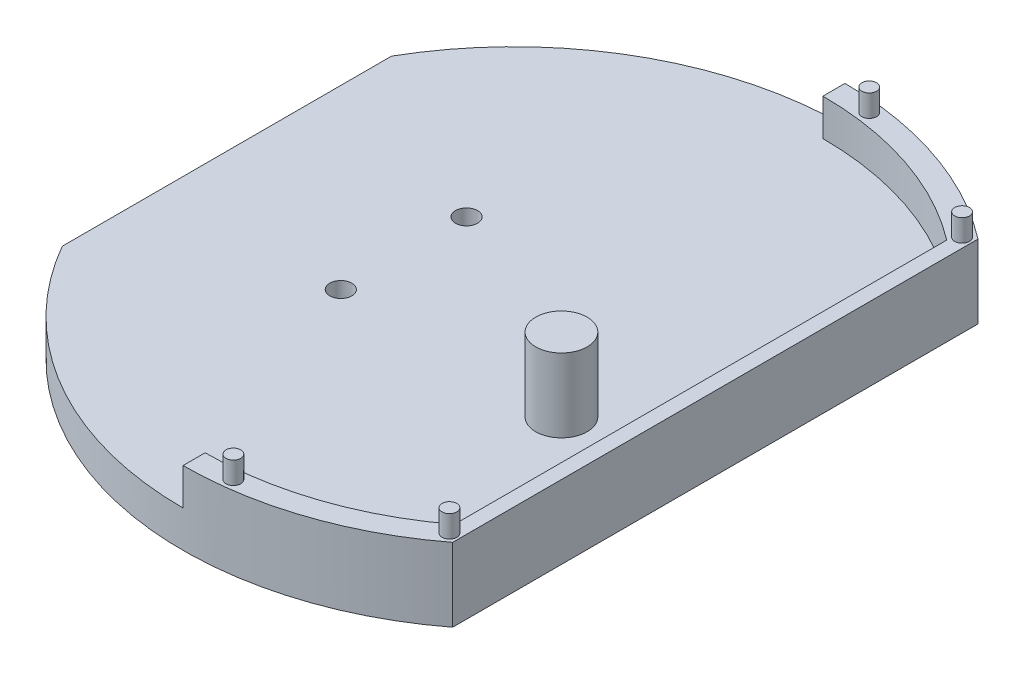
ISO-10303-21;
HEADER;
FILE_DESCRIPTION(('STEP AP214'),'2;1');
FILE_NAME('part.step','',(''),(''),'','','');
FILE_SCHEMA(('AUTOMOTIVE_DESIGN { 1 0 10303 214 1 1 1 1 }'));
ENDSEC;
DATA;
#1=APPLICATION_CONTEXT('core data for automotive mechanical design processes');
#2=APPLICATION_PROTOCOL_DEFINITION('international standard','automotive_design',2000,#1);
#3=PRODUCT_CONTEXT('',#1,'mechanical');
#4=PRODUCT('Part','Part','',(#3));
#5=PRODUCT_RELATED_PRODUCT_CATEGORY('part','',(#4));
#6=PRODUCT_DEFINITION_FORMATION('','',#4);
#7=PRODUCT_DEFINITION_CONTEXT('part definition',#1,'design');
#8=PRODUCT_DEFINITION('design','',#6,#7);
#9=PRODUCT_DEFINITION_SHAPE('','',#8);
#10=(LENGTH_UNIT() NAMED_UNIT(*) SI_UNIT(.MILLI.,.METRE.));
#11=(NAMED_UNIT(*) PLANE_ANGLE_UNIT() SI_UNIT($,.RADIAN.));
#12=(NAMED_UNIT(*) SI_UNIT($,.STERADIAN.) SOLID_ANGLE_UNIT());
#13=UNCERTAINTY_MEASURE_WITH_UNIT(LENGTH_MEASURE(1.E-05),#10,'distance_accuracy_value','');
#14=(GEOMETRIC_REPRESENTATION_CONTEXT(3) GLOBAL_UNCERTAINTY_ASSIGNED_CONTEXT((#13)) GLOBAL_UNIT_ASSIGNED_CONTEXT((#10,
#11,#12)) REPRESENTATION_CONTEXT('',''));
#15=CARTESIAN_POINT('',(0.,0.,0.));
#16=DIRECTION('',(0.,0.,1.));
#17=DIRECTION('',(1.,0.,0.));
#18=AXIS2_PLACEMENT_3D('',#15,#16,#17);
#19=CARTESIAN_POINT('',(0.,0.,0.));
#20=DIRECTION('',(0.,1.,0.));
#21=DIRECTION('',(0.,0.,1.));
#22=AXIS2_PLACEMENT_3D('',#19,#20,#21);
#23=PLANE('',#22);
#24=DIRECTION('',(0.,0.,-1.));
#25=VECTOR('',#24,1.);
#26=CARTESIAN_POINT('',(27.3745309307479,0.,0.));
#27=LINE('',#26,#25);
#28=CARTESIAN_POINT('',(27.3745309307479,0.,35.7160336028726));
#29=VERTEX_POINT('',#28);
#30=CARTESIAN_POINT('',(27.3745309307479,0.,-35.7160336028726));
#31=VERTEX_POINT('',#30);
#32=EDGE_CURVE('E247',#29,#31,#27,.T.);
#33=ORIENTED_EDGE('',*,*,#32,.F.);
#34=CARTESIAN_POINT('',(0.,0.,0.));
#35=DIRECTION('',(0.,1.,0.));
#36=DIRECTION('',(0.,0.,1.));
#37=AXIS2_PLACEMENT_3D('',#34,#35,#36);
#38=CIRCLE('',#37,45.);
#39=CARTESIAN_POINT('',(-39.0385613575621,0.,22.3828221440429));
#40=VERTEX_POINT('',#39);
#41=EDGE_CURVE('E225',#40,#29,#38,.T.);
#42=ORIENTED_EDGE('',*,*,#41,.F.);
#43=DIRECTION('',(0.,0.,-1.));
#44=VECTOR('',#43,1.);
#45=CARTESIAN_POINT('',(-39.0385613575621,0.,0.));
#46=LINE('',#45,#44);
#47=CARTESIAN_POINT('',(-39.0385613575621,0.,-22.3828221440429));
#48=VERTEX_POINT('',#47);
#49=EDGE_CURVE('E255',#40,#48,#46,.T.);
#50=ORIENTED_EDGE('',*,*,#49,.T.);
#51=CARTESIAN_POINT('',(0.,0.,0.));
#52=DIRECTION('',(0.,1.,0.));
#53=DIRECTION('',(0.,0.,1.));
#54=AXIS2_PLACEMENT_3D('',#51,#52,#53);
#55=CIRCLE('',#54,45.);
#56=EDGE_CURVE('E251',#31,#48,#55,.T.);
#57=ORIENTED_EDGE('',*,*,#56,.F.);
#58=EDGE_LOOP('',(#33,#42,#50,#57));
#59=FACE_BOUND('',#58,.T.);
#60=CARTESIAN_POINT('',(-15.,0.,-8.55000000000001));
#61=DIRECTION('',(0.,1.,0.));
#62=DIRECTION('',(0.,0.,1.));
#63=AXIS2_PLACEMENT_3D('',#60,#61,#62);
#64=CIRCLE('',#63,1.5);
#65=CARTESIAN_POINT('',(-15.,0.,-7.05000000000001));
#66=VERTEX_POINT('',#65);
#67=EDGE_CURVE('E243',#66,#66,#64,.T.);
#68=ORIENTED_EDGE('',*,*,#67,.T.);
#69=EDGE_LOOP('',(#68));
#70=FACE_BOUND('',#69,.T.);
#71=CARTESIAN_POINT('',(-15.,0.,8.54999999999999));
#72=DIRECTION('',(0.,1.,0.));
#73=DIRECTION('',(0.,0.,1.));
#74=AXIS2_PLACEMENT_3D('',#71,#72,#73);
#75=CIRCLE('',#74,1.5);
#76=CARTESIAN_POINT('',(-15.,0.,10.05));
#77=VERTEX_POINT('',#76);
#78=EDGE_CURVE('E216',#77,#77,#75,.T.);
#79=ORIENTED_EDGE('',*,*,#78,.T.);
#80=EDGE_LOOP('',(#79));
#81=FACE_BOUND('',#80,.T.);
#82=ADVANCED_FACE('F56',(#59,#70,#81),#23,.F.);
#83=CARTESIAN_POINT('',(0.,5.,0.));
#84=DIRECTION('',(0.,1.,0.));
#85=DIRECTION('',(0.,0.,1.));
#86=AXIS2_PLACEMENT_3D('',#83,#84,#85);
#87=PLANE('',#86);
#88=DIRECTION('',(0.,0.,-1.));
#89=VECTOR('',#88,1.);
#90=CARTESIAN_POINT('',(0.,5.,0.));
#91=LINE('',#90,#89);
#92=CARTESIAN_POINT('',(0.,5.,45.));
#93=VERTEX_POINT('',#92);
#94=CARTESIAN_POINT('',(0.,5.,42.));
#95=VERTEX_POINT('',#94);
#96=EDGE_CURVE('E72',#93,#95,#91,.T.);
#97=ORIENTED_EDGE('',*,*,#96,.T.);
#98=CARTESIAN_POINT('',(0.,5.,0.));
#99=DIRECTION('',(0.,1.,0.));
#100=DIRECTION('',(0.,0.,1.));
#101=AXIS2_PLACEMENT_3D('',#98,#99,#100);
#102=CIRCLE('',#101,42.);
#103=CARTESIAN_POINT('',(25.374530930748,5.,33.4683907597081));
#104=VERTEX_POINT('',#103);
#105=EDGE_CURVE('E139',#95,#104,#102,.T.);
#106=ORIENTED_EDGE('',*,*,#105,.T.);
#107=DIRECTION('',(0.,0.,-1.));
#108=VECTOR('',#107,1.);
#109=CARTESIAN_POINT('',(25.374530930748,5.,0.));
#110=LINE('',#109,#108);
#111=CARTESIAN_POINT('',(25.374530930748,5.,-33.4683907597081));
#112=VERTEX_POINT('',#111);
#113=EDGE_CURVE('E155',#104,#112,#110,.T.);
#114=ORIENTED_EDGE('',*,*,#113,.T.);
#115=CARTESIAN_POINT('',(0.,5.,0.));
#116=DIRECTION('',(0.,1.,0.));
#117=DIRECTION('',(0.,0.,1.));
#118=AXIS2_PLACEMENT_3D('',#115,#116,#117);
#119=CIRCLE('',#118,42.);
#120=CARTESIAN_POINT('',(0.,5.,-42.));
#121=VERTEX_POINT('',#120);
#122=EDGE_CURVE('E79',#112,#121,#119,.T.);
#123=ORIENTED_EDGE('',*,*,#122,.T.);
#124=DIRECTION('',(0.,0.,-1.));
#125=VECTOR('',#124,1.);
#126=CARTESIAN_POINT('',(0.,5.,0.));
#127=LINE('',#126,#125);
#128=CARTESIAN_POINT('',(0.,5.,-45.));
#129=VERTEX_POINT('',#128);
#130=EDGE_CURVE('E190',#121,#129,#127,.T.);
#131=ORIENTED_EDGE('',*,*,#130,.T.);
#132=CARTESIAN_POINT('',(0.,5.,0.));
#133=DIRECTION('',(0.,1.,0.));
#134=DIRECTION('',(0.,0.,1.));
#135=AXIS2_PLACEMENT_3D('',#132,#133,#134);
#136=CIRCLE('',#135,45.);
#137=CARTESIAN_POINT('',(-39.0385613575621,5.,-22.3828221440429));
#138=VERTEX_POINT('',#137);
#139=EDGE_CURVE('E229',#129,#138,#136,.T.);
#140=ORIENTED_EDGE('',*,*,#139,.T.);
#141=DIRECTION('',(0.,0.,-1.));
#142=VECTOR('',#141,1.);
#143=CARTESIAN_POINT('',(-39.0385613575621,5.,0.));
#144=LINE('',#143,#142);
#145=CARTESIAN_POINT('',(-39.0385613575621,5.,22.3828221440429));
#146=VERTEX_POINT('',#145);
#147=EDGE_CURVE('E232',#146,#138,#144,.T.);
#148=ORIENTED_EDGE('',*,*,#147,.F.);
#149=CARTESIAN_POINT('',(0.,5.,0.));
#150=DIRECTION('',(0.,1.,0.));
#151=DIRECTION('',(0.,0.,1.));
#152=AXIS2_PLACEMENT_3D('',#149,#150,#151);
#153=CIRCLE('',#152,45.);
#154=EDGE_CURVE('E236',#146,#93,#153,.T.);
#155=ORIENTED_EDGE('',*,*,#154,.T.);
#156=EDGE_LOOP('',(#97,#106,#114,#123,#131,#140,#148,#155));
#157=FACE_BOUND('',#156,.T.);
#158=CARTESIAN_POINT('',(15.,5.,8.54999999999999));
#159=DIRECTION('',(0.,1.,0.));
#160=DIRECTION('',(0.,0.,1.));
#161=AXIS2_PLACEMENT_3D('',#158,#159,#160);
#162=CIRCLE('',#161,3.5);
#163=CARTESIAN_POINT('',(15.,5.,12.05));
#164=VERTEX_POINT('',#163);
#165=EDGE_CURVE('E143',#164,#164,#162,.T.);
#166=ORIENTED_EDGE('',*,*,#165,.F.);
#167=EDGE_LOOP('',(#166));
#168=FACE_BOUND('',#167,.T.);
#169=CARTESIAN_POINT('',(-15.,5.,8.54999999999999));
#170=DIRECTION('',(0.,1.,0.));
#171=DIRECTION('',(0.,0.,1.));
#172=AXIS2_PLACEMENT_3D('',#169,#170,#171);
#173=CIRCLE('',#172,1.5);
#174=CARTESIAN_POINT('',(-15.,5.,10.05));
#175=VERTEX_POINT('',#174);
#176=EDGE_CURVE('E220',#175,#175,#173,.T.);
#177=ORIENTED_EDGE('',*,*,#176,.F.);
#178=EDGE_LOOP('',(#177));
#179=FACE_BOUND('',#178,.T.);
#180=CARTESIAN_POINT('',(-15.,5.,-8.55000000000001));
#181=DIRECTION('',(0.,1.,0.));
#182=DIRECTION('',(0.,0.,1.));
#183=AXIS2_PLACEMENT_3D('',#180,#181,#182);
#184=CIRCLE('',#183,1.5);
#185=CARTESIAN_POINT('',(-15.,5.,-7.05000000000001));
#186=VERTEX_POINT('',#185);
#187=EDGE_CURVE('E224',#186,#186,#184,.T.);
#188=ORIENTED_EDGE('',*,*,#187,.F.);
#189=EDGE_LOOP('',(#188));
#190=FACE_BOUND('',#189,.T.);
#191=ADVANCED_FACE('F296',(#157,#168,#179,#190),#87,.T.);
#192=CARTESIAN_POINT('',(-15.,5.,8.54999999999999));
#193=DIRECTION('',(0.,-1.,0.));
#194=DIRECTION('',(0.,0.,-1.));
#195=AXIS2_PLACEMENT_3D('',#192,#193,#194);
#196=CYLINDRICAL_SURFACE('',#195,1.5);
#197=ORIENTED_EDGE('',*,*,#176,.T.);
#198=EDGE_LOOP('',(#197));
#199=FACE_BOUND('',#198,.T.);
#200=ORIENTED_EDGE('',*,*,#78,.F.);
#201=EDGE_LOOP('',(#200));
#202=FACE_BOUND('',#201,.T.);
#203=ADVANCED_FACE('F58',(#199,#202),#196,.F.);
#204=CARTESIAN_POINT('',(-15.,5.,-8.55000000000001));
#205=DIRECTION('',(0.,-1.,0.));
#206=DIRECTION('',(0.,0.,-1.));
#207=AXIS2_PLACEMENT_3D('',#204,#205,#206);
#208=CYLINDRICAL_SURFACE('',#207,1.5);
#209=ORIENTED_EDGE('',*,*,#187,.T.);
#210=EDGE_LOOP('',(#209));
#211=FACE_BOUND('',#210,.T.);
#212=ORIENTED_EDGE('',*,*,#67,.F.);
#213=EDGE_LOOP('',(#212));
#214=FACE_BOUND('',#213,.T.);
#215=ADVANCED_FACE('F307',(#211,#214),#208,.F.);
#216=CARTESIAN_POINT('',(0.,5.,0.));
#217=DIRECTION('',(0.,-1.,0.));
#218=DIRECTION('',(0.,0.,-1.));
#219=AXIS2_PLACEMENT_3D('',#216,#217,#218);
#220=CYLINDRICAL_SURFACE('',#219,45.);
#221=ORIENTED_EDGE('',*,*,#56,.T.);
#222=DIRECTION('',(0.,-1.,0.));
#223=VECTOR('',#222,1.);
#224=CARTESIAN_POINT('',(-39.0385613575621,5.,-22.3828221440429));
#225=LINE('',#224,#223);
#226=EDGE_CURVE('E65',#138,#48,#225,.T.);
#227=ORIENTED_EDGE('',*,*,#226,.F.);
#228=ORIENTED_EDGE('',*,*,#139,.F.);
#229=DIRECTION('',(0.,-1.,0.));
#230=VECTOR('',#229,1.);
#231=CARTESIAN_POINT('',(0.,10.,-45.));
#232=LINE('',#231,#230);
#233=CARTESIAN_POINT('',(0.,10.,-45.));
#234=VERTEX_POINT('',#233);
#235=EDGE_CURVE('E206',#234,#129,#232,.T.);
#236=ORIENTED_EDGE('',*,*,#235,.F.);
#237=CARTESIAN_POINT('',(0.,10.,0.));
#238=DIRECTION('',(0.,1.,0.));
#239=DIRECTION('',(0.,0.,1.));
#240=AXIS2_PLACEMENT_3D('',#237,#238,#239);
#241=CIRCLE('',#240,45.);
#242=CARTESIAN_POINT('',(27.3745309307479,10.,-35.7160336028726));
#243=VERTEX_POINT('',#242);
#244=EDGE_CURVE('E171',#243,#234,#241,.T.);
#245=ORIENTED_EDGE('',*,*,#244,.F.);
#246=DIRECTION('',(0.,-1.,0.));
#247=VECTOR('',#246,1.);
#248=CARTESIAN_POINT('',(27.3745309307479,5.,-35.7160336028726));
#249=LINE('',#248,#247);
#250=EDGE_CURVE('E12',#243,#31,#249,.T.);
#251=ORIENTED_EDGE('',*,*,#250,.T.);
#252=EDGE_LOOP('',(#221,#227,#228,#236,#245,#251));
#253=FACE_BOUND('',#252,.T.);
#254=ADVANCED_FACE('F274',(#253),#220,.T.);
#255=CARTESIAN_POINT('',(-39.0385613575621,5.,0.));
#256=DIRECTION('',(-1.,0.,0.));
#257=DIRECTION('',(0.,0.,1.));
#258=AXIS2_PLACEMENT_3D('',#255,#256,#257);
#259=PLANE('',#258);
#260=ORIENTED_EDGE('',*,*,#49,.F.);
#261=DIRECTION('',(0.,-1.,0.));
#262=VECTOR('',#261,1.);
#263=CARTESIAN_POINT('',(-39.0385613575621,5.,22.3828221440429));
#264=LINE('',#263,#262);
#265=EDGE_CURVE('E264',#146,#40,#264,.T.);
#266=ORIENTED_EDGE('',*,*,#265,.F.);
#267=ORIENTED_EDGE('',*,*,#147,.T.);
#268=ORIENTED_EDGE('',*,*,#226,.T.);
#269=EDGE_LOOP('',(#260,#266,#267,#268));
#270=FACE_BOUND('',#269,.T.);
#271=ADVANCED_FACE('F270',(#270),#259,.T.);
#272=CARTESIAN_POINT('',(0.,5.,0.));
#273=DIRECTION('',(0.,-1.,0.));
#274=DIRECTION('',(0.,0.,-1.));
#275=AXIS2_PLACEMENT_3D('',#272,#273,#274);
#276=CYLINDRICAL_SURFACE('',#275,45.);
#277=ORIENTED_EDGE('',*,*,#41,.T.);
#278=DIRECTION('',(0.,-1.,0.));
#279=VECTOR('',#278,1.);
#280=CARTESIAN_POINT('',(27.3745309307479,5.,35.7160336028726));
#281=LINE('',#280,#279);
#282=CARTESIAN_POINT('',(27.3745309307479,10.,35.7160336028726));
#283=VERTEX_POINT('',#282);
#284=EDGE_CURVE('E239',#283,#29,#281,.T.);
#285=ORIENTED_EDGE('',*,*,#284,.F.);
#286=CARTESIAN_POINT('',(0.,10.,0.));
#287=DIRECTION('',(0.,1.,0.));
#288=DIRECTION('',(0.,0.,1.));
#289=AXIS2_PLACEMENT_3D('',#286,#287,#288);
#290=CIRCLE('',#289,45.);
#291=CARTESIAN_POINT('',(0.,10.,45.));
#292=VERTEX_POINT('',#291);
#293=EDGE_CURVE('E161',#292,#283,#290,.T.);
#294=ORIENTED_EDGE('',*,*,#293,.F.);
#295=DIRECTION('',(0.,-1.,0.));
#296=VECTOR('',#295,1.);
#297=CARTESIAN_POINT('',(0.,10.,45.));
#298=LINE('',#297,#296);
#299=EDGE_CURVE('E144',#292,#93,#298,.T.);
#300=ORIENTED_EDGE('',*,*,#299,.T.);
#301=ORIENTED_EDGE('',*,*,#154,.F.);
#302=ORIENTED_EDGE('',*,*,#265,.T.);
#303=EDGE_LOOP('',(#277,#285,#294,#300,#301,#302));
#304=FACE_BOUND('',#303,.T.);
#305=ADVANCED_FACE('F281',(#304),#276,.T.);
#306=CARTESIAN_POINT('',(27.3745309307479,5.,0.));
#307=DIRECTION('',(-1.,0.,0.));
#308=DIRECTION('',(0.,0.,1.));
#309=AXIS2_PLACEMENT_3D('',#306,#307,#308);
#310=PLANE('',#309);
#311=ORIENTED_EDGE('',*,*,#32,.T.);
#312=ORIENTED_EDGE('',*,*,#250,.F.);
#313=DIRECTION('',(0.,0.,-1.));
#314=VECTOR('',#313,1.);
#315=CARTESIAN_POINT('',(27.3745309307479,10.,0.));
#316=LINE('',#315,#314);
#317=EDGE_CURVE('E164',#283,#243,#316,.T.);
#318=ORIENTED_EDGE('',*,*,#317,.F.);
#319=ORIENTED_EDGE('',*,*,#284,.T.);
#320=EDGE_LOOP('',(#311,#312,#318,#319));
#321=FACE_BOUND('',#320,.T.);
#322=ADVANCED_FACE('F285',(#321),#310,.F.);
#323=CARTESIAN_POINT('',(15.,15.,8.54999999999999));
#324=DIRECTION('',(0.,-1.,0.));
#325=DIRECTION('',(0.,0.,-1.));
#326=AXIS2_PLACEMENT_3D('',#323,#324,#325);
#327=CYLINDRICAL_SURFACE('',#326,3.5);
#328=CARTESIAN_POINT('',(15.,15.,8.54999999999999));
#329=DIRECTION('',(0.,1.,0.));
#330=DIRECTION('',(0.,0.,1.));
#331=AXIS2_PLACEMENT_3D('',#328,#329,#330);
#332=CIRCLE('',#331,3.5);
#333=CARTESIAN_POINT('',(15.,15.,12.05));
#334=VERTEX_POINT('',#333);
#335=EDGE_CURVE('E212',#334,#334,#332,.T.);
#336=ORIENTED_EDGE('',*,*,#335,.F.);
#337=EDGE_LOOP('',(#336));
#338=FACE_BOUND('',#337,.T.);
#339=ORIENTED_EDGE('',*,*,#165,.T.);
#340=EDGE_LOOP('',(#339));
#341=FACE_BOUND('',#340,.T.);
#342=ADVANCED_FACE('F300',(#338,#341),#327,.T.);
#343=CARTESIAN_POINT('',(15.,15.,8.54999999999999));
#344=DIRECTION('',(0.,1.,0.));
#345=DIRECTION('',(0.,0.,1.));
#346=AXIS2_PLACEMENT_3D('',#343,#344,#345);
#347=PLANE('',#346);
#348=ORIENTED_EDGE('',*,*,#335,.T.);
#349=EDGE_LOOP('',(#348));
#350=FACE_BOUND('',#349,.T.);
#351=ADVANCED_FACE('F340',(#350),#347,.T.);
#352=CARTESIAN_POINT('',(0.,10.,0.));
#353=DIRECTION('',(0.,-1.,0.));
#354=DIRECTION('',(0.,0.,-1.));
#355=AXIS2_PLACEMENT_3D('',#352,#353,#354);
#356=CYLINDRICAL_SURFACE('',#355,42.);
#357=ORIENTED_EDGE('',*,*,#105,.F.);
#358=DIRECTION('',(0.,-1.,0.));
#359=VECTOR('',#358,1.);
#360=CARTESIAN_POINT('',(0.,10.,42.));
#361=LINE('',#360,#359);
#362=CARTESIAN_POINT('',(0.,10.,42.));
#363=VERTEX_POINT('',#362);
#364=EDGE_CURVE('E133',#363,#95,#361,.T.);
#365=ORIENTED_EDGE('',*,*,#364,.F.);
#366=CARTESIAN_POINT('',(0.,10.,0.));
#367=DIRECTION('',(0.,1.,0.));
#368=DIRECTION('',(0.,0.,1.));
#369=AXIS2_PLACEMENT_3D('',#366,#367,#368);
#370=CIRCLE('',#369,42.);
#371=CARTESIAN_POINT('',(25.374530930748,10.,33.4683907597081));
#372=VERTEX_POINT('',#371);
#373=EDGE_CURVE('E137',#363,#372,#370,.T.);
#374=ORIENTED_EDGE('',*,*,#373,.T.);
#375=DIRECTION('',(0.,-1.,0.));
#376=VECTOR('',#375,1.);
#377=CARTESIAN_POINT('',(25.374530930748,10.,33.4683907597081));
#378=LINE('',#377,#376);
#379=EDGE_CURVE('E184',#372,#104,#378,.T.);
#380=ORIENTED_EDGE('',*,*,#379,.T.);
#381=EDGE_LOOP('',(#357,#365,#374,#380));
#382=FACE_BOUND('',#381,.T.);
#383=ADVANCED_FACE('F135',(#382),#356,.F.);
#384=CARTESIAN_POINT('',(0.,10.,0.));
#385=DIRECTION('',(-1.,0.,0.));
#386=DIRECTION('',(0.,0.,1.));
#387=AXIS2_PLACEMENT_3D('',#384,#385,#386);
#388=PLANE('',#387);
#389=ORIENTED_EDGE('',*,*,#96,.F.);
#390=ORIENTED_EDGE('',*,*,#299,.F.);
#391=DIRECTION('',(0.,0.,-1.));
#392=VECTOR('',#391,1.);
#393=CARTESIAN_POINT('',(0.,10.,0.));
#394=LINE('',#393,#392);
#395=EDGE_CURVE('E150',#292,#363,#394,.T.);
#396=ORIENTED_EDGE('',*,*,#395,.T.);
#397=ORIENTED_EDGE('',*,*,#364,.T.);
#398=EDGE_LOOP('',(#389,#390,#396,#397));
#399=FACE_BOUND('',#398,.T.);
#400=ADVANCED_FACE('F157',(#399),#388,.T.);
#401=CARTESIAN_POINT('',(0.,10.,0.));
#402=DIRECTION('',(-1.,0.,0.));
#403=DIRECTION('',(0.,0.,1.));
#404=AXIS2_PLACEMENT_3D('',#401,#402,#403);
#405=PLANE('',#404);
#406=ORIENTED_EDGE('',*,*,#130,.F.);
#407=DIRECTION('',(0.,-1.,0.));
#408=VECTOR('',#407,1.);
#409=CARTESIAN_POINT('',(0.,10.,-42.));
#410=LINE('',#409,#408);
#411=CARTESIAN_POINT('',(0.,10.,-42.));
#412=VERTEX_POINT('',#411);
#413=EDGE_CURVE('E203',#412,#121,#410,.T.);
#414=ORIENTED_EDGE('',*,*,#413,.F.);
#415=DIRECTION('',(0.,0.,-1.));
#416=VECTOR('',#415,1.);
#417=CARTESIAN_POINT('',(0.,10.,0.));
#418=LINE('',#417,#416);
#419=EDGE_CURVE('E174',#412,#234,#418,.T.);
#420=ORIENTED_EDGE('',*,*,#419,.T.);
#421=ORIENTED_EDGE('',*,*,#235,.T.);
#422=EDGE_LOOP('',(#406,#414,#420,#421));
#423=FACE_BOUND('',#422,.T.);
#424=ADVANCED_FACE('F290',(#423),#405,.T.);
#425=CARTESIAN_POINT('',(0.,10.,0.));
#426=DIRECTION('',(0.,-1.,0.));
#427=DIRECTION('',(0.,0.,-1.));
#428=AXIS2_PLACEMENT_3D('',#425,#426,#427);
#429=CYLINDRICAL_SURFACE('',#428,42.);
#430=ORIENTED_EDGE('',*,*,#122,.F.);
#431=DIRECTION('',(0.,-1.,0.));
#432=VECTOR('',#431,1.);
#433=CARTESIAN_POINT('',(25.374530930748,10.,-33.4683907597081));
#434=LINE('',#433,#432);
#435=CARTESIAN_POINT('',(25.374530930748,10.,-33.4683907597081));
#436=VERTEX_POINT('',#435);
#437=EDGE_CURVE('E199',#436,#112,#434,.T.);
#438=ORIENTED_EDGE('',*,*,#437,.F.);
#439=CARTESIAN_POINT('',(0.,10.,0.));
#440=DIRECTION('',(0.,1.,0.));
#441=DIRECTION('',(0.,0.,1.));
#442=AXIS2_PLACEMENT_3D('',#439,#440,#441);
#443=CIRCLE('',#442,42.);
#444=EDGE_CURVE('E178',#436,#412,#443,.T.);
#445=ORIENTED_EDGE('',*,*,#444,.T.);
#446=ORIENTED_EDGE('',*,*,#413,.T.);
#447=EDGE_LOOP('',(#430,#438,#445,#446));
#448=FACE_BOUND('',#447,.T.);
#449=ADVANCED_FACE('F292',(#448),#429,.F.);
#450=CARTESIAN_POINT('',(25.374530930748,10.,0.));
#451=DIRECTION('',(-1.,0.,0.));
#452=DIRECTION('',(0.,0.,1.));
#453=AXIS2_PLACEMENT_3D('',#450,#451,#452);
#454=PLANE('',#453);
#455=ORIENTED_EDGE('',*,*,#113,.F.);
#456=ORIENTED_EDGE('',*,*,#379,.F.);
#457=DIRECTION('',(0.,0.,-1.));
#458=VECTOR('',#457,1.);
#459=CARTESIAN_POINT('',(25.374530930748,10.,0.));
#460=LINE('',#459,#458);
#461=EDGE_CURVE('E153',#372,#436,#460,.T.);
#462=ORIENTED_EDGE('',*,*,#461,.T.);
#463=ORIENTED_EDGE('',*,*,#437,.T.);
#464=EDGE_LOOP('',(#455,#456,#462,#463));
#465=FACE_BOUND('',#464,.T.);
#466=ADVANCED_FACE('F295',(#465),#454,.T.);
#467=CARTESIAN_POINT('',(0.,10.,0.));
#468=DIRECTION('',(0.,1.,0.));
#469=DIRECTION('',(0.,0.,1.));
#470=AXIS2_PLACEMENT_3D('',#467,#468,#469);
#471=PLANE('',#470);
#472=CARTESIAN_POINT('',(5.07453093074795,10.,43.2269779961275));
#473=DIRECTION('',(0.,1.,0.));
#474=DIRECTION('',(0.,0.,1.));
#475=AXIS2_PLACEMENT_3D('',#472,#473,#474);
#476=CIRCLE('',#475,1.);
#477=CARTESIAN_POINT('',(5.07453093074795,10.,44.2269779961275));
#478=VERTEX_POINT('',#477);
#479=EDGE_CURVE('E571',#478,#478,#476,.T.);
#480=ORIENTED_EDGE('',*,*,#479,.F.);
#481=EDGE_LOOP('',(#480));
#482=FACE_BOUND('',#481,.T.);
#483=CARTESIAN_POINT('',(26.074530930748,10.,34.8488353834999));
#484=DIRECTION('',(0.,1.,0.));
#485=DIRECTION('',(0.,0.,1.));
#486=AXIS2_PLACEMENT_3D('',#483,#484,#485);
#487=CIRCLE('',#486,1.);
#488=CARTESIAN_POINT('',(26.074530930748,10.,35.8488353834999));
#489=VERTEX_POINT('',#488);
#490=EDGE_CURVE('E570',#489,#489,#487,.T.);
#491=ORIENTED_EDGE('',*,*,#490,.F.);
#492=EDGE_LOOP('',(#491));
#493=FACE_BOUND('',#492,.T.);
#494=CARTESIAN_POINT('',(26.074530930748,10.,-34.8488353834999));
#495=DIRECTION('',(0.,1.,0.));
#496=DIRECTION('',(0.,0.,1.));
#497=AXIS2_PLACEMENT_3D('',#494,#495,#496);
#498=CIRCLE('',#497,1.);
#499=CARTESIAN_POINT('',(26.074530930748,10.,-33.8488353834999));
#500=VERTEX_POINT('',#499);
#501=EDGE_CURVE('E583',#500,#500,#498,.T.);
#502=ORIENTED_EDGE('',*,*,#501,.F.);
#503=EDGE_LOOP('',(#502));
#504=FACE_BOUND('',#503,.T.);
#505=CARTESIAN_POINT('',(5.07453093074795,10.,-43.2269779961275));
#506=DIRECTION('',(0.,1.,0.));
#507=DIRECTION('',(0.,0.,1.));
#508=AXIS2_PLACEMENT_3D('',#505,#506,#507);
#509=CIRCLE('',#508,1.);
#510=CARTESIAN_POINT('',(5.07453093074795,10.,-42.2269779961275));
#511=VERTEX_POINT('',#510);
#512=EDGE_CURVE('E589',#511,#511,#509,.T.);
#513=ORIENTED_EDGE('',*,*,#512,.F.);
#514=EDGE_LOOP('',(#513));
#515=FACE_BOUND('',#514,.T.);
#516=ORIENTED_EDGE('',*,*,#373,.F.);
#517=ORIENTED_EDGE('',*,*,#395,.F.);
#518=ORIENTED_EDGE('',*,*,#293,.T.);
#519=ORIENTED_EDGE('',*,*,#317,.T.);
#520=ORIENTED_EDGE('',*,*,#244,.T.);
#521=ORIENTED_EDGE('',*,*,#419,.F.);
#522=ORIENTED_EDGE('',*,*,#444,.F.);
#523=ORIENTED_EDGE('',*,*,#461,.F.);
#524=EDGE_LOOP('',(#516,#517,#518,#519,#520,#521,#522,#523));
#525=FACE_BOUND('',#524,.T.);
#526=ADVANCED_FACE('F148',(#482,#493,#504,#515,#525),#471,.T.);
#527=CARTESIAN_POINT('',(5.07453093074795,13.,-43.2269779961275));
#528=DIRECTION('',(0.,-1.,0.));
#529=DIRECTION('',(0.,0.,-1.));
#530=AXIS2_PLACEMENT_3D('',#527,#528,#529);
#531=CYLINDRICAL_SURFACE('',#530,1.);
#532=CARTESIAN_POINT('',(5.07453093074795,13.,-43.2269779961275));
#533=DIRECTION('',(0.,1.,0.));
#534=DIRECTION('',(0.,0.,1.));
#535=AXIS2_PLACEMENT_3D('',#532,#533,#534);
#536=CIRCLE('',#535,1.);
#537=CARTESIAN_POINT('',(5.07453093074795,13.,-42.2269779961275));
#538=VERTEX_POINT('',#537);
#539=EDGE_CURVE('E187',#538,#538,#536,.T.);
#540=ORIENTED_EDGE('',*,*,#539,.F.);
#541=EDGE_LOOP('',(#540));
#542=FACE_BOUND('',#541,.T.);
#543=ORIENTED_EDGE('',*,*,#512,.T.);
#544=EDGE_LOOP('',(#543));
#545=FACE_BOUND('',#544,.T.);
#546=ADVANCED_FACE('F403',(#542,#545),#531,.T.);
#547=CARTESIAN_POINT('',(0.,13.,0.));
#548=DIRECTION('',(0.,1.,0.));
#549=DIRECTION('',(0.,0.,1.));
#550=AXIS2_PLACEMENT_3D('',#547,#548,#549);
#551=PLANE('',#550);
#552=ORIENTED_EDGE('',*,*,#539,.T.);
#553=EDGE_LOOP('',(#552));
#554=FACE_BOUND('',#553,.T.);
#555=ADVANCED_FACE('F411',(#554),#551,.T.);
#556=CARTESIAN_POINT('',(26.074530930748,13.,-34.8488353834999));
#557=DIRECTION('',(0.,-1.,0.));
#558=DIRECTION('',(0.,0.,-1.));
#559=AXIS2_PLACEMENT_3D('',#556,#557,#558);
#560=CYLINDRICAL_SURFACE('',#559,1.);
#561=CARTESIAN_POINT('',(26.074530930748,13.,-34.8488353834999));
#562=DIRECTION('',(0.,1.,0.));
#563=DIRECTION('',(0.,0.,1.));
#564=AXIS2_PLACEMENT_3D('',#561,#562,#563);
#565=CIRCLE('',#564,1.);
#566=CARTESIAN_POINT('',(26.074530930748,13.,-33.8488353834999));
#567=VERTEX_POINT('',#566);
#568=EDGE_CURVE('E585',#567,#567,#565,.T.);
#569=ORIENTED_EDGE('',*,*,#568,.F.);
#570=EDGE_LOOP('',(#569));
#571=FACE_BOUND('',#570,.T.);
#572=ORIENTED_EDGE('',*,*,#501,.T.);
#573=EDGE_LOOP('',(#572));
#574=FACE_BOUND('',#573,.T.);
#575=ADVANCED_FACE('F419',(#571,#574),#560,.T.);
#576=CARTESIAN_POINT('',(0.,13.,0.));
#577=DIRECTION('',(0.,1.,0.));
#578=DIRECTION('',(0.,0.,1.));
#579=AXIS2_PLACEMENT_3D('',#576,#577,#578);
#580=PLANE('',#579);
#581=ORIENTED_EDGE('',*,*,#568,.T.);
#582=EDGE_LOOP('',(#581));
#583=FACE_BOUND('',#582,.T.);
#584=ADVANCED_FACE('F427',(#583),#580,.T.);
#585=CARTESIAN_POINT('',(26.074530930748,13.,34.8488353834999));
#586=DIRECTION('',(0.,-1.,0.));
#587=DIRECTION('',(0.,0.,-1.));
#588=AXIS2_PLACEMENT_3D('',#585,#586,#587);
#589=CYLINDRICAL_SURFACE('',#588,1.);
#590=CARTESIAN_POINT('',(26.074530930748,13.,34.8488353834999));
#591=DIRECTION('',(0.,1.,0.));
#592=DIRECTION('',(0.,0.,1.));
#593=AXIS2_PLACEMENT_3D('',#590,#591,#592);
#594=CIRCLE('',#593,1.);
#595=CARTESIAN_POINT('',(26.074530930748,13.,35.8488353834999));
#596=VERTEX_POINT('',#595);
#597=EDGE_CURVE('E576',#596,#596,#594,.T.);
#598=ORIENTED_EDGE('',*,*,#597,.F.);
#599=EDGE_LOOP('',(#598));
#600=FACE_BOUND('',#599,.T.);
#601=ORIENTED_EDGE('',*,*,#490,.T.);
#602=EDGE_LOOP('',(#601));
#603=FACE_BOUND('',#602,.T.);
#604=ADVANCED_FACE('F435',(#600,#603),#589,.T.);
#605=CARTESIAN_POINT('',(0.,13.,0.));
#606=DIRECTION('',(0.,1.,0.));
#607=DIRECTION('',(0.,0.,1.));
#608=AXIS2_PLACEMENT_3D('',#605,#606,#607);
#609=PLANE('',#608);
#610=ORIENTED_EDGE('',*,*,#597,.T.);
#611=EDGE_LOOP('',(#610));
#612=FACE_BOUND('',#611,.T.);
#613=ADVANCED_FACE('F443',(#612),#609,.T.);
#614=CARTESIAN_POINT('',(5.07453093074795,13.,43.2269779961275));
#615=DIRECTION('',(0.,-1.,0.));
#616=DIRECTION('',(0.,0.,-1.));
#617=AXIS2_PLACEMENT_3D('',#614,#615,#616);
#618=CYLINDRICAL_SURFACE('',#617,1.);
#619=CARTESIAN_POINT('',(5.07453093074795,13.,43.2269779961275));
#620=DIRECTION('',(0.,1.,0.));
#621=DIRECTION('',(0.,0.,1.));
#622=AXIS2_PLACEMENT_3D('',#619,#620,#621);
#623=CIRCLE('',#622,1.);
#624=CARTESIAN_POINT('',(5.07453093074795,13.,44.2269779961275));
#625=VERTEX_POINT('',#624);
#626=EDGE_CURVE('E568',#625,#625,#623,.T.);
#627=ORIENTED_EDGE('',*,*,#626,.F.);
#628=EDGE_LOOP('',(#627));
#629=FACE_BOUND('',#628,.T.);
#630=ORIENTED_EDGE('',*,*,#479,.T.);
#631=EDGE_LOOP('',(#630));
#632=FACE_BOUND('',#631,.T.);
#633=ADVANCED_FACE('F451',(#629,#632),#618,.T.);
#634=CARTESIAN_POINT('',(0.,13.,0.));
#635=DIRECTION('',(0.,1.,0.));
#636=DIRECTION('',(0.,0.,1.));
#637=AXIS2_PLACEMENT_3D('',#634,#635,#636);
#638=PLANE('',#637);
#639=ORIENTED_EDGE('',*,*,#626,.T.);
#640=EDGE_LOOP('',(#639));
#641=FACE_BOUND('',#640,.T.);
#642=ADVANCED_FACE('F459',(#641),#638,.T.);
#643=CLOSED_SHELL('',(#82,#191,#203,#215,#254,#271,#305,#322,#342,#351,#383,#400,#424,#449,#466,
#526,#546,#555,#575,#584,#604,#613,#633,#642));
#644=MANIFOLD_SOLID_BREP('B2',#643);
#645=ADVANCED_BREP_SHAPE_REPRESENTATION('',(#18,#644),#14);
#646=SHAPE_DEFINITION_REPRESENTATION(#9,#645);
ENDSEC;
END-ISO-10303-21;
